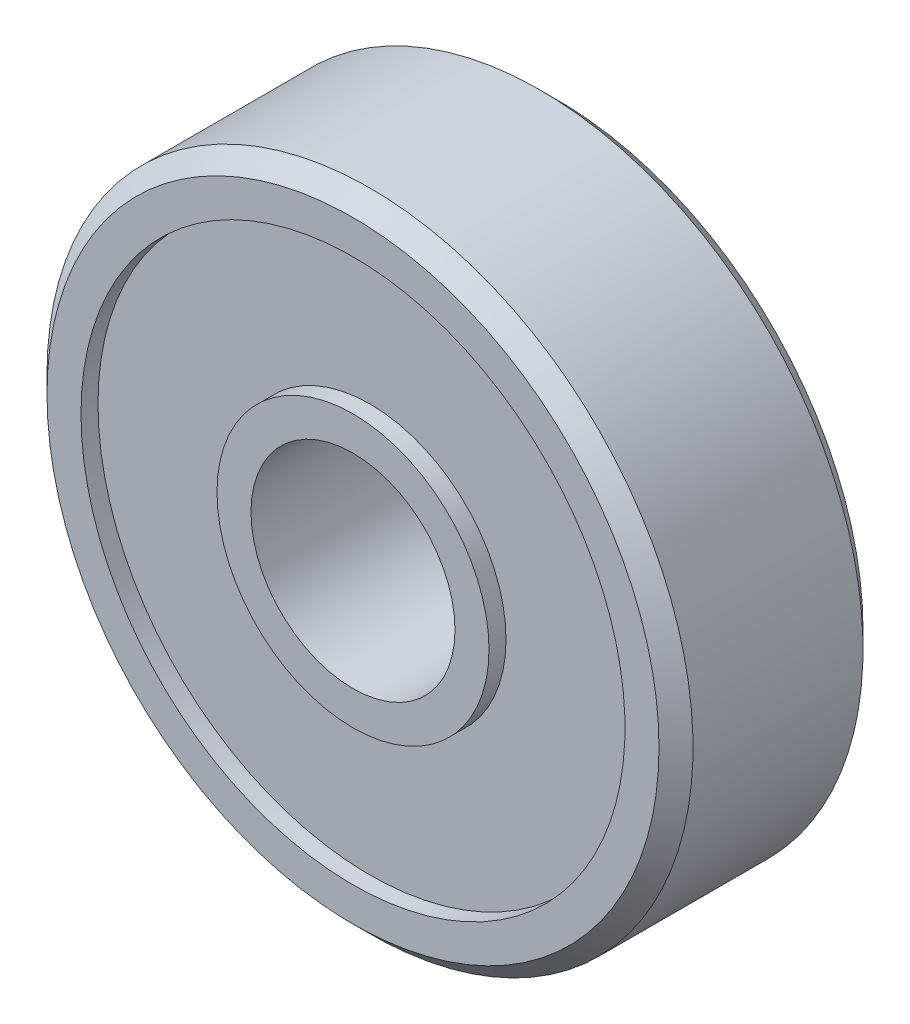
ISO-10303-21;
HEADER;
FILE_DESCRIPTION(('STEP AP214'),'2;1');
FILE_NAME('part.step','',(''),(''),'','','');
FILE_SCHEMA(('AUTOMOTIVE_DESIGN { 1 0 10303 214 1 1 1 1 }'));
ENDSEC;
DATA;
#1=APPLICATION_CONTEXT('core data for automotive mechanical design processes');
#2=APPLICATION_PROTOCOL_DEFINITION('international standard','automotive_design',2000,#1);
#3=PRODUCT_CONTEXT('',#1,'mechanical');
#4=PRODUCT('Part','Part','',(#3));
#5=PRODUCT_RELATED_PRODUCT_CATEGORY('part','',(#4));
#6=PRODUCT_DEFINITION_FORMATION('','',#4);
#7=PRODUCT_DEFINITION_CONTEXT('part definition',#1,'design');
#8=PRODUCT_DEFINITION('design','',#6,#7);
#9=PRODUCT_DEFINITION_SHAPE('','',#8);
#10=(LENGTH_UNIT() NAMED_UNIT(*) SI_UNIT(.MILLI.,.METRE.));
#11=(NAMED_UNIT(*) PLANE_ANGLE_UNIT() SI_UNIT($,.RADIAN.));
#12=(NAMED_UNIT(*) SI_UNIT($,.STERADIAN.) SOLID_ANGLE_UNIT());
#13=UNCERTAINTY_MEASURE_WITH_UNIT(LENGTH_MEASURE(1.E-05),#10,'distance_accuracy_value','');
#14=(GEOMETRIC_REPRESENTATION_CONTEXT(3) GLOBAL_UNCERTAINTY_ASSIGNED_CONTEXT((#13)) GLOBAL_UNIT_ASSIGNED_CONTEXT((#10,
#11,#12)) REPRESENTATION_CONTEXT('',''));
#15=CARTESIAN_POINT('',(0.,0.,0.));
#16=DIRECTION('',(0.,0.,1.));
#17=DIRECTION('',(1.,0.,0.));
#18=AXIS2_PLACEMENT_3D('',#15,#16,#17);
#19=CARTESIAN_POINT('',(0.,0.,0.500000000000005));
#20=DIRECTION('',(0.,0.,-1.));
#21=DIRECTION('',(-1.,0.,0.));
#22=AXIS2_PLACEMENT_3D('',#19,#20,#21);
#23=CYLINDRICAL_SURFACE('',#22,9.5);
#24=CARTESIAN_POINT('',(0.,0.,1.));
#25=DIRECTION('',(0.,0.,-1.));
#26=DIRECTION('',(-1.,0.,0.));
#27=AXIS2_PLACEMENT_3D('',#24,#25,#26);
#28=CIRCLE('',#27,9.5);
#29=CARTESIAN_POINT('',(-9.5,0.,0.999999999999997));
#30=VERTEX_POINT('',#29);
#31=EDGE_CURVE('E10',#30,#30,#28,.T.);
#32=ORIENTED_EDGE('',*,*,#31,.T.);
#33=EDGE_LOOP('',(#32));
#34=FACE_BOUND('',#33,.T.);
#35=CARTESIAN_POINT('',(0.,0.,-4.));
#36=DIRECTION('',(0.,0.,-1.));
#37=DIRECTION('',(-1.,0.,0.));
#38=AXIS2_PLACEMENT_3D('',#35,#36,#37);
#39=CIRCLE('',#38,9.5);
#40=CARTESIAN_POINT('',(-9.49999999999999,0.,-4.));
#41=VERTEX_POINT('',#40);
#42=EDGE_CURVE('E75',#41,#41,#39,.T.);
#43=ORIENTED_EDGE('',*,*,#42,.F.);
#44=EDGE_LOOP('',(#43));
#45=FACE_BOUND('',#44,.T.);
#46=ADVANCED_FACE('F29',(#34,#45),#23,.T.);
#47=CARTESIAN_POINT('',(0.,0.,1.));
#48=DIRECTION('',(0.,0.,-1.));
#49=DIRECTION('',(-1.,0.,0.));
#50=AXIS2_PLACEMENT_3D('',#47,#48,#49);
#51=CONICAL_SURFACE('',#50,9.5,0.785398163397458);
#52=CARTESIAN_POINT('',(0.,0.,1.5));
#53=DIRECTION('',(0.,0.,-1.));
#54=DIRECTION('',(-1.,0.,0.));
#55=AXIS2_PLACEMENT_3D('',#52,#53,#54);
#56=CIRCLE('',#55,8.99999999999999);
#57=CARTESIAN_POINT('',(-8.99999999999999,0.,1.5));
#58=VERTEX_POINT('',#57);
#59=EDGE_CURVE('E35',#58,#58,#56,.T.);
#60=ORIENTED_EDGE('',*,*,#59,.T.);
#61=EDGE_LOOP('',(#60));
#62=FACE_BOUND('',#61,.T.);
#63=ORIENTED_EDGE('',*,*,#31,.F.);
#64=EDGE_LOOP('',(#63));
#65=FACE_BOUND('',#64,.T.);
#66=ADVANCED_FACE('F83',(#62,#65),#51,.T.);
#67=CARTESIAN_POINT('',(8.99999999999999,0.,1.5));
#68=DIRECTION('',(0.,0.,1.));
#69=DIRECTION('',(1.,0.,0.));
#70=AXIS2_PLACEMENT_3D('',#67,#68,#69);
#71=PLANE('',#70);
#72=CARTESIAN_POINT('',(0.,0.,1.5));
#73=DIRECTION('',(0.,0.,-1.));
#74=DIRECTION('',(-1.,0.,0.));
#75=AXIS2_PLACEMENT_3D('',#72,#73,#74);
#76=CIRCLE('',#75,8.);
#77=CARTESIAN_POINT('',(-8.,0.,1.5));
#78=VERTEX_POINT('',#77);
#79=EDGE_CURVE('E39',#78,#78,#76,.T.);
#80=ORIENTED_EDGE('',*,*,#79,.T.);
#81=EDGE_LOOP('',(#80));
#82=FACE_BOUND('',#81,.T.);
#83=ORIENTED_EDGE('',*,*,#59,.F.);
#84=EDGE_LOOP('',(#83));
#85=FACE_BOUND('',#84,.T.);
#86=ADVANCED_FACE('F87',(#82,#85),#71,.T.);
#87=CARTESIAN_POINT('',(0.,0.,0.500000000000005));
#88=DIRECTION('',(0.,0.,-1.));
#89=DIRECTION('',(-1.,0.,0.));
#90=AXIS2_PLACEMENT_3D('',#87,#88,#89);
#91=CYLINDRICAL_SURFACE('',#90,8.);
#92=CARTESIAN_POINT('',(0.,0.,0.999999999999999));
#93=DIRECTION('',(0.,0.,-1.));
#94=DIRECTION('',(-1.,0.,0.));
#95=AXIS2_PLACEMENT_3D('',#92,#93,#94);
#96=CIRCLE('',#95,8.);
#97=CARTESIAN_POINT('',(-8.,0.,0.999999999999997));
#98=VERTEX_POINT('',#97);
#99=EDGE_CURVE('E43',#98,#98,#96,.T.);
#100=ORIENTED_EDGE('',*,*,#99,.T.);
#101=EDGE_LOOP('',(#100));
#102=FACE_BOUND('',#101,.T.);
#103=ORIENTED_EDGE('',*,*,#79,.F.);
#104=EDGE_LOOP('',(#103));
#105=FACE_BOUND('',#104,.T.);
#106=ADVANCED_FACE('F91',(#102,#105),#91,.F.);
#107=CARTESIAN_POINT('',(8.,0.,1.));
#108=DIRECTION('',(0.,0.,1.));
#109=DIRECTION('',(1.,0.,0.));
#110=AXIS2_PLACEMENT_3D('',#107,#108,#109);
#111=PLANE('',#110);
#112=CARTESIAN_POINT('',(0.,0.,1.));
#113=DIRECTION('',(0.,0.,-1.));
#114=DIRECTION('',(-1.,0.,0.));
#115=AXIS2_PLACEMENT_3D('',#112,#113,#114);
#116=CIRCLE('',#115,4.);
#117=CARTESIAN_POINT('',(-4.,0.,0.999999999999999));
#118=VERTEX_POINT('',#117);
#119=EDGE_CURVE('E48',#118,#118,#116,.T.);
#120=ORIENTED_EDGE('',*,*,#119,.T.);
#121=EDGE_LOOP('',(#120));
#122=FACE_BOUND('',#121,.T.);
#123=ORIENTED_EDGE('',*,*,#99,.F.);
#124=EDGE_LOOP('',(#123));
#125=FACE_BOUND('',#124,.T.);
#126=ADVANCED_FACE('F98',(#122,#125),#111,.T.);
#127=CARTESIAN_POINT('',(0.,0.,0.500000000000005));
#128=DIRECTION('',(0.,0.,-1.));
#129=DIRECTION('',(-1.,0.,0.));
#130=AXIS2_PLACEMENT_3D('',#127,#128,#129);
#131=CYLINDRICAL_SURFACE('',#130,4.);
#132=CARTESIAN_POINT('',(0.,0.,1.5));
#133=DIRECTION('',(0.,0.,-1.));
#134=DIRECTION('',(-1.,0.,0.));
#135=AXIS2_PLACEMENT_3D('',#132,#133,#134);
#136=CIRCLE('',#135,4.);
#137=CARTESIAN_POINT('',(-4.,0.,1.5));
#138=VERTEX_POINT('',#137);
#139=EDGE_CURVE('E51',#138,#138,#136,.T.);
#140=ORIENTED_EDGE('',*,*,#139,.T.);
#141=EDGE_LOOP('',(#140));
#142=FACE_BOUND('',#141,.T.);
#143=ORIENTED_EDGE('',*,*,#119,.F.);
#144=EDGE_LOOP('',(#143));
#145=FACE_BOUND('',#144,.T.);
#146=ADVANCED_FACE('F102',(#142,#145),#131,.T.);
#147=CARTESIAN_POINT('',(4.,0.,1.5));
#148=DIRECTION('',(0.,0.,1.));
#149=DIRECTION('',(1.,0.,0.));
#150=AXIS2_PLACEMENT_3D('',#147,#148,#149);
#151=PLANE('',#150);
#152=CARTESIAN_POINT('',(0.,0.,1.5));
#153=DIRECTION('',(0.,0.,-1.));
#154=DIRECTION('',(-1.,0.,0.));
#155=AXIS2_PLACEMENT_3D('',#152,#153,#154);
#156=CIRCLE('',#155,3.);
#157=CARTESIAN_POINT('',(-3.,0.,1.5));
#158=VERTEX_POINT('',#157);
#159=EDGE_CURVE('E54',#158,#158,#156,.T.);
#160=ORIENTED_EDGE('',*,*,#159,.T.);
#161=EDGE_LOOP('',(#160));
#162=FACE_BOUND('',#161,.T.);
#163=ORIENTED_EDGE('',*,*,#139,.F.);
#164=EDGE_LOOP('',(#163));
#165=FACE_BOUND('',#164,.T.);
#166=ADVANCED_FACE('F106',(#162,#165),#151,.T.);
#167=CARTESIAN_POINT('',(0.,0.,0.500000000000005));
#168=DIRECTION('',(0.,0.,-1.));
#169=DIRECTION('',(-1.,0.,0.));
#170=AXIS2_PLACEMENT_3D('',#167,#168,#169);
#171=CYLINDRICAL_SURFACE('',#170,3.);
#172=CARTESIAN_POINT('',(0.,0.,-4.5));
#173=DIRECTION('',(0.,0.,-1.));
#174=DIRECTION('',(-1.,0.,0.));
#175=AXIS2_PLACEMENT_3D('',#172,#173,#174);
#176=CIRCLE('',#175,3.);
#177=CARTESIAN_POINT('',(-2.99999999999999,0.,-4.5));
#178=VERTEX_POINT('',#177);
#179=EDGE_CURVE('E57',#178,#178,#176,.T.);
#180=ORIENTED_EDGE('',*,*,#179,.T.);
#181=EDGE_LOOP('',(#180));
#182=FACE_BOUND('',#181,.T.);
#183=ORIENTED_EDGE('',*,*,#159,.F.);
#184=EDGE_LOOP('',(#183));
#185=FACE_BOUND('',#184,.T.);
#186=ADVANCED_FACE('F110',(#182,#185),#171,.F.);
#187=CARTESIAN_POINT('',(3.,0.,-4.5));
#188=DIRECTION('',(0.,0.,-1.));
#189=DIRECTION('',(-1.,0.,0.));
#190=AXIS2_PLACEMENT_3D('',#187,#188,#189);
#191=PLANE('',#190);
#192=CARTESIAN_POINT('',(0.,0.,-4.5));
#193=DIRECTION('',(0.,0.,-1.));
#194=DIRECTION('',(-1.,0.,0.));
#195=AXIS2_PLACEMENT_3D('',#192,#193,#194);
#196=CIRCLE('',#195,4.);
#197=CARTESIAN_POINT('',(-3.99999999999999,0.,-4.5));
#198=VERTEX_POINT('',#197);
#199=EDGE_CURVE('E60',#198,#198,#196,.T.);
#200=ORIENTED_EDGE('',*,*,#199,.T.);
#201=EDGE_LOOP('',(#200));
#202=FACE_BOUND('',#201,.T.);
#203=ORIENTED_EDGE('',*,*,#179,.F.);
#204=EDGE_LOOP('',(#203));
#205=FACE_BOUND('',#204,.T.);
#206=ADVANCED_FACE('F114',(#202,#205),#191,.T.);
#207=CARTESIAN_POINT('',(0.,0.,0.500000000000005));
#208=DIRECTION('',(0.,0.,-1.));
#209=DIRECTION('',(-1.,0.,0.));
#210=AXIS2_PLACEMENT_3D('',#207,#208,#209);
#211=CYLINDRICAL_SURFACE('',#210,4.);
#212=CARTESIAN_POINT('',(0.,0.,-4.));
#213=DIRECTION('',(0.,0.,-1.));
#214=DIRECTION('',(-1.,0.,0.));
#215=AXIS2_PLACEMENT_3D('',#212,#213,#214);
#216=CIRCLE('',#215,4.);
#217=CARTESIAN_POINT('',(-3.99999999999999,0.,-4.));
#218=VERTEX_POINT('',#217);
#219=EDGE_CURVE('E63',#218,#218,#216,.T.);
#220=ORIENTED_EDGE('',*,*,#219,.T.);
#221=EDGE_LOOP('',(#220));
#222=FACE_BOUND('',#221,.T.);
#223=ORIENTED_EDGE('',*,*,#199,.F.);
#224=EDGE_LOOP('',(#223));
#225=FACE_BOUND('',#224,.T.);
#226=ADVANCED_FACE('F118',(#222,#225),#211,.T.);
#227=CARTESIAN_POINT('',(4.,0.,-4.));
#228=DIRECTION('',(0.,0.,-1.));
#229=DIRECTION('',(-1.,0.,0.));
#230=AXIS2_PLACEMENT_3D('',#227,#228,#229);
#231=PLANE('',#230);
#232=CARTESIAN_POINT('',(0.,0.,-4.));
#233=DIRECTION('',(0.,0.,-1.));
#234=DIRECTION('',(-1.,0.,0.));
#235=AXIS2_PLACEMENT_3D('',#232,#233,#234);
#236=CIRCLE('',#235,8.);
#237=CARTESIAN_POINT('',(-8.,0.,-4.));
#238=VERTEX_POINT('',#237);
#239=EDGE_CURVE('E66',#238,#238,#236,.T.);
#240=ORIENTED_EDGE('',*,*,#239,.T.);
#241=EDGE_LOOP('',(#240));
#242=FACE_BOUND('',#241,.T.);
#243=ORIENTED_EDGE('',*,*,#219,.F.);
#244=EDGE_LOOP('',(#243));
#245=FACE_BOUND('',#244,.T.);
#246=ADVANCED_FACE('F122',(#242,#245),#231,.T.);
#247=CARTESIAN_POINT('',(0.,0.,0.500000000000005));
#248=DIRECTION('',(0.,0.,-1.));
#249=DIRECTION('',(-1.,0.,0.));
#250=AXIS2_PLACEMENT_3D('',#247,#248,#249);
#251=CYLINDRICAL_SURFACE('',#250,8.);
#252=CARTESIAN_POINT('',(0.,0.,-4.5));
#253=DIRECTION('',(0.,0.,-1.));
#254=DIRECTION('',(-1.,0.,0.));
#255=AXIS2_PLACEMENT_3D('',#252,#253,#254);
#256=CIRCLE('',#255,8.);
#257=CARTESIAN_POINT('',(-8.,0.,-4.5));
#258=VERTEX_POINT('',#257);
#259=EDGE_CURVE('E69',#258,#258,#256,.T.);
#260=ORIENTED_EDGE('',*,*,#259,.T.);
#261=EDGE_LOOP('',(#260));
#262=FACE_BOUND('',#261,.T.);
#263=ORIENTED_EDGE('',*,*,#239,.F.);
#264=EDGE_LOOP('',(#263));
#265=FACE_BOUND('',#264,.T.);
#266=ADVANCED_FACE('F126',(#262,#265),#251,.F.);
#267=CARTESIAN_POINT('',(8.,0.,-4.5));
#268=DIRECTION('',(0.,0.,-1.));
#269=DIRECTION('',(-1.,0.,0.));
#270=AXIS2_PLACEMENT_3D('',#267,#268,#269);
#271=PLANE('',#270);
#272=CARTESIAN_POINT('',(0.,0.,-4.5));
#273=DIRECTION('',(0.,0.,-1.));
#274=DIRECTION('',(-1.,0.,0.));
#275=AXIS2_PLACEMENT_3D('',#272,#273,#274);
#276=CIRCLE('',#275,8.99999999999999);
#277=CARTESIAN_POINT('',(-8.99999999999999,0.,-4.50000000000001));
#278=VERTEX_POINT('',#277);
#279=EDGE_CURVE('E72',#278,#278,#276,.T.);
#280=ORIENTED_EDGE('',*,*,#279,.T.);
#281=EDGE_LOOP('',(#280));
#282=FACE_BOUND('',#281,.T.);
#283=ORIENTED_EDGE('',*,*,#259,.F.);
#284=EDGE_LOOP('',(#283));
#285=FACE_BOUND('',#284,.T.);
#286=ADVANCED_FACE('F130',(#282,#285),#271,.T.);
#287=CARTESIAN_POINT('',(0.,0.,-4.5));
#288=DIRECTION('',(0.,0.,1.));
#289=DIRECTION('',(1.,0.,0.));
#290=AXIS2_PLACEMENT_3D('',#287,#288,#289);
#291=CONICAL_SURFACE('',#290,8.99999999999999,0.785398163397453);
#292=ORIENTED_EDGE('',*,*,#42,.T.);
#293=EDGE_LOOP('',(#292));
#294=FACE_BOUND('',#293,.T.);
#295=ORIENTED_EDGE('',*,*,#279,.F.);
#296=EDGE_LOOP('',(#295));
#297=FACE_BOUND('',#296,.T.);
#298=ADVANCED_FACE('F79',(#294,#297),#291,.T.);
#299=CLOSED_SHELL('',(#46,#66,#86,#106,#126,#146,#166,#186,#206,#226,#246,#266,#286,#298));
#300=MANIFOLD_SOLID_BREP('B2',#299);
#301=ADVANCED_BREP_SHAPE_REPRESENTATION('',(#18,#300),#14);
#302=SHAPE_DEFINITION_REPRESENTATION(#9,#301);
ENDSEC;
END-ISO-10303-21;
